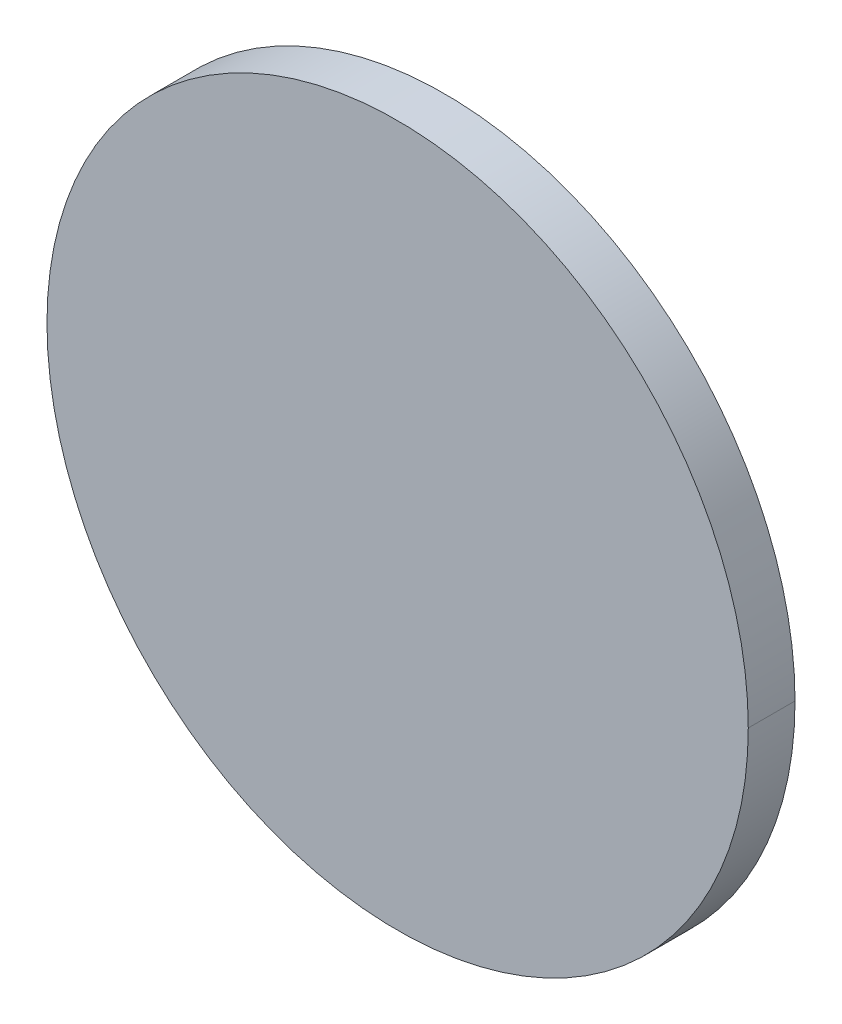
ISO-10303-21;
HEADER;
FILE_DESCRIPTION(('STEP AP214'),'2;1');
FILE_NAME('part.step','',(''),(''),'','','');
FILE_SCHEMA(('AUTOMOTIVE_DESIGN { 1 0 10303 214 1 1 1 1 }'));
ENDSEC;
DATA;
#1=APPLICATION_CONTEXT('core data for automotive mechanical design processes');
#2=APPLICATION_PROTOCOL_DEFINITION('international standard','automotive_design',2000,#1);
#3=PRODUCT_CONTEXT('',#1,'mechanical');
#4=PRODUCT('Part','Part','',(#3));
#5=PRODUCT_RELATED_PRODUCT_CATEGORY('part','',(#4));
#6=PRODUCT_DEFINITION_FORMATION('','',#4);
#7=PRODUCT_DEFINITION_CONTEXT('part definition',#1,'design');
#8=PRODUCT_DEFINITION('design','',#6,#7);
#9=PRODUCT_DEFINITION_SHAPE('','',#8);
#10=(LENGTH_UNIT() NAMED_UNIT(*) SI_UNIT(.MILLI.,.METRE.));
#11=(NAMED_UNIT(*) PLANE_ANGLE_UNIT() SI_UNIT($,.RADIAN.));
#12=(NAMED_UNIT(*) SI_UNIT($,.STERADIAN.) SOLID_ANGLE_UNIT());
#13=UNCERTAINTY_MEASURE_WITH_UNIT(LENGTH_MEASURE(1.E-05),#10,'distance_accuracy_value','');
#14=(GEOMETRIC_REPRESENTATION_CONTEXT(3) GLOBAL_UNCERTAINTY_ASSIGNED_CONTEXT((#13)) GLOBAL_UNIT_ASSIGNED_CONTEXT((#10,
#11,#12)) REPRESENTATION_CONTEXT('',''));
#15=CARTESIAN_POINT('',(0.,0.,0.));
#16=DIRECTION('',(0.,0.,1.));
#17=DIRECTION('',(1.,0.,0.));
#18=AXIS2_PLACEMENT_3D('',#15,#16,#17);
#19=CARTESIAN_POINT('',(-1.3,1.25,2.05));
#20=DIRECTION('',(0.,0.,1.));
#21=DIRECTION('',(1.,0.,0.));
#22=AXIS2_PLACEMENT_3D('',#19,#20,#21);
#23=PLANE('',#22);
#24=CARTESIAN_POINT('',(-1.3,1.25,2.05));
#25=DIRECTION('',(0.,0.,-1.));
#26=DIRECTION('',(-1.,0.,0.));
#27=AXIS2_PLACEMENT_3D('',#24,#25,#26);
#28=CIRCLE('',#27,0.375);
#29=CARTESIAN_POINT('',(-1.675,1.25,2.05));
#30=VERTEX_POINT('',#29);
#31=CARTESIAN_POINT('',(-0.925,1.25,2.05));
#32=VERTEX_POINT('',#31);
#33=EDGE_CURVE('E62',#30,#32,#28,.T.);
#34=ORIENTED_EDGE('',*,*,#33,.F.);
#35=CARTESIAN_POINT('',(-1.3,1.25,2.05));
#36=DIRECTION('',(0.,0.,-1.));
#37=DIRECTION('',(-1.,0.,0.));
#38=AXIS2_PLACEMENT_3D('',#35,#36,#37);
#39=CIRCLE('',#38,0.375);
#40=EDGE_CURVE('E11',#32,#30,#39,.T.);
#41=ORIENTED_EDGE('',*,*,#40,.F.);
#42=EDGE_LOOP('',(#34,#41));
#43=FACE_BOUND('',#42,.T.);
#44=ADVANCED_FACE('F16',(#43),#23,.T.);
#45=CARTESIAN_POINT('',(-1.3,1.25,2.05));
#46=DIRECTION('',(0.,0.,-1.));
#47=DIRECTION('',(-1.,0.,0.));
#48=AXIS2_PLACEMENT_3D('',#45,#46,#47);
#49=CYLINDRICAL_SURFACE('',#48,0.375);
#50=DIRECTION('',(0.,0.,-1.));
#51=VECTOR('',#50,1.);
#52=CARTESIAN_POINT('',(-0.925,1.25,2.05));
#53=LINE('',#52,#51);
#54=CARTESIAN_POINT('',(-0.925,1.25,2.));
#55=VERTEX_POINT('',#54);
#56=EDGE_CURVE('E59',#32,#55,#53,.T.);
#57=ORIENTED_EDGE('',*,*,#56,.F.);
#58=ORIENTED_EDGE('',*,*,#40,.T.);
#59=DIRECTION('',(0.,0.,-1.));
#60=VECTOR('',#59,1.);
#61=CARTESIAN_POINT('',(-1.675,1.25,2.05));
#62=LINE('',#61,#60);
#63=CARTESIAN_POINT('',(-1.675,1.25,2.));
#64=VERTEX_POINT('',#63);
#65=EDGE_CURVE('E56',#30,#64,#62,.T.);
#66=ORIENTED_EDGE('',*,*,#65,.T.);
#67=CARTESIAN_POINT('',(-1.3,1.25,2.));
#68=DIRECTION('',(0.,0.,1.));
#69=DIRECTION('',(-1.,0.,0.));
#70=AXIS2_PLACEMENT_3D('',#67,#68,#69);
#71=CIRCLE('',#70,0.375);
#72=EDGE_CURVE('E20',#64,#55,#71,.T.);
#73=ORIENTED_EDGE('',*,*,#72,.T.);
#74=EDGE_LOOP('',(#57,#58,#66,#73));
#75=FACE_BOUND('',#74,.T.);
#76=ADVANCED_FACE('F55',(#75),#49,.T.);
#77=CARTESIAN_POINT('',(-1.3,1.25,2.));
#78=DIRECTION('',(0.,0.,1.));
#79=DIRECTION('',(1.,0.,0.));
#80=AXIS2_PLACEMENT_3D('',#77,#78,#79);
#81=PLANE('',#80);
#82=ORIENTED_EDGE('',*,*,#72,.F.);
#83=CARTESIAN_POINT('',(-1.3,1.25,2.));
#84=DIRECTION('',(0.,0.,1.));
#85=DIRECTION('',(-1.,0.,0.));
#86=AXIS2_PLACEMENT_3D('',#83,#84,#85);
#87=CIRCLE('',#86,0.375);
#88=EDGE_CURVE('E63',#55,#64,#87,.T.);
#89=ORIENTED_EDGE('',*,*,#88,.F.);
#90=EDGE_LOOP('',(#82,#89));
#91=FACE_BOUND('',#90,.T.);
#92=ADVANCED_FACE('F110',(#91),#81,.F.);
#93=CARTESIAN_POINT('',(-1.3,1.25,2.05));
#94=DIRECTION('',(0.,0.,-1.));
#95=DIRECTION('',(-1.,0.,0.));
#96=AXIS2_PLACEMENT_3D('',#93,#94,#95);
#97=CYLINDRICAL_SURFACE('',#96,0.375);
#98=ORIENTED_EDGE('',*,*,#33,.T.);
#99=ORIENTED_EDGE('',*,*,#56,.T.);
#100=ORIENTED_EDGE('',*,*,#88,.T.);
#101=ORIENTED_EDGE('',*,*,#65,.F.);
#102=EDGE_LOOP('',(#98,#99,#100,#101));
#103=FACE_BOUND('',#102,.T.);
#104=ADVANCED_FACE('F18',(#103),#97,.T.);
#105=CLOSED_SHELL('',(#44,#76,#92,#104));
#106=MANIFOLD_SOLID_BREP('B1',#105);
#107=ADVANCED_BREP_SHAPE_REPRESENTATION('',(#18,#106),#14);
#108=SHAPE_DEFINITION_REPRESENTATION(#9,#107);
ENDSEC;
END-ISO-10303-21;
